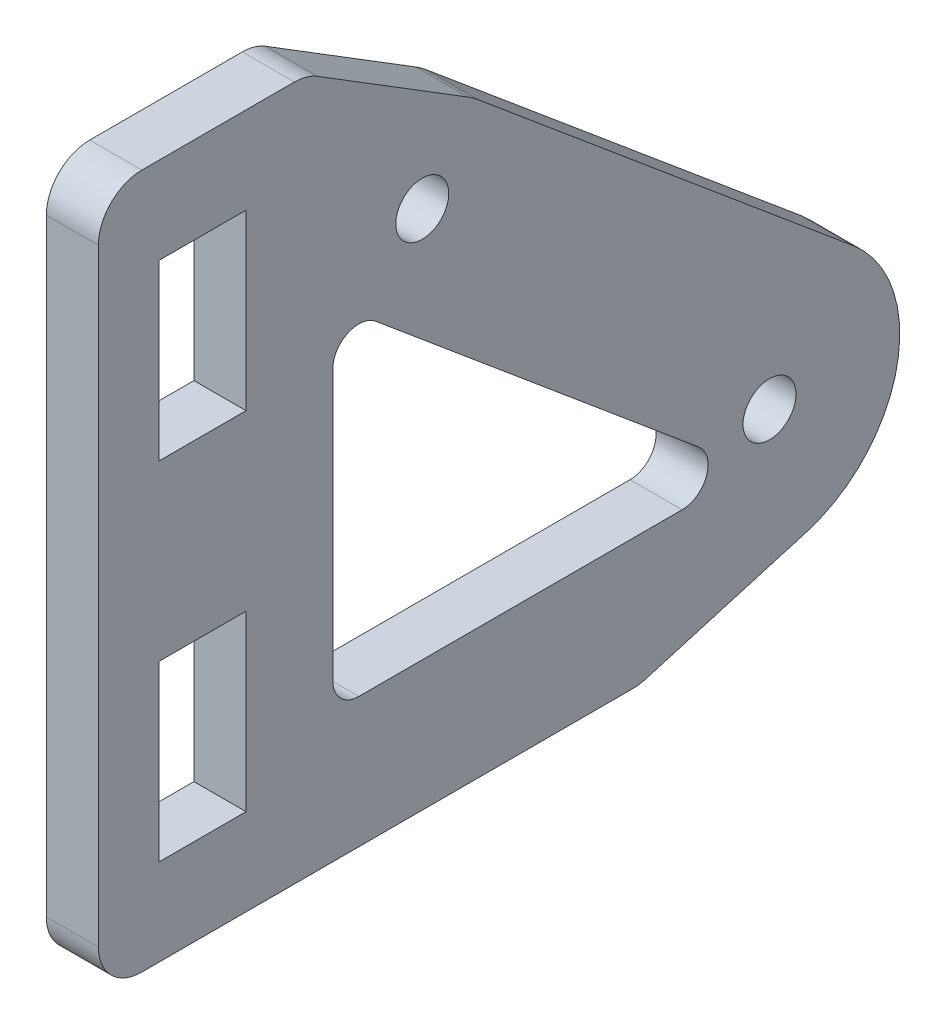
ISO-10303-21;
HEADER;
FILE_DESCRIPTION(('STEP AP214'),'2;1');
FILE_NAME('part.step','',(''),(''),'','','');
FILE_SCHEMA(('AUTOMOTIVE_DESIGN { 1 0 10303 214 1 1 1 1 }'));
ENDSEC;
DATA;
#1=APPLICATION_CONTEXT('core data for automotive mechanical design processes');
#2=APPLICATION_PROTOCOL_DEFINITION('international standard','automotive_design',2000,#1);
#3=PRODUCT_CONTEXT('',#1,'mechanical');
#4=PRODUCT('Part','Part','',(#3));
#5=PRODUCT_RELATED_PRODUCT_CATEGORY('part','',(#4));
#6=PRODUCT_DEFINITION_FORMATION('','',#4);
#7=PRODUCT_DEFINITION_CONTEXT('part definition',#1,'design');
#8=PRODUCT_DEFINITION('design','',#6,#7);
#9=PRODUCT_DEFINITION_SHAPE('','',#8);
#10=(LENGTH_UNIT() NAMED_UNIT(*) SI_UNIT(.MILLI.,.METRE.));
#11=(NAMED_UNIT(*) PLANE_ANGLE_UNIT() SI_UNIT($,.RADIAN.));
#12=(NAMED_UNIT(*) SI_UNIT($,.STERADIAN.) SOLID_ANGLE_UNIT());
#13=UNCERTAINTY_MEASURE_WITH_UNIT(LENGTH_MEASURE(1.E-05),#10,'distance_accuracy_value','');
#14=(GEOMETRIC_REPRESENTATION_CONTEXT(3) GLOBAL_UNCERTAINTY_ASSIGNED_CONTEXT((#13)) GLOBAL_UNIT_ASSIGNED_CONTEXT((#10,
#11,#12)) REPRESENTATION_CONTEXT('',''));
#15=CARTESIAN_POINT('',(0.,0.,0.));
#16=DIRECTION('',(0.,0.,1.));
#17=DIRECTION('',(1.,0.,0.));
#18=AXIS2_PLACEMENT_3D('',#15,#16,#17);
#19=CARTESIAN_POINT('',(1.5,-7.5,7.85714285714286));
#20=DIRECTION('',(1.,0.,0.));
#21=DIRECTION('',(0.,0.,-1.));
#22=AXIS2_PLACEMENT_3D('',#19,#20,#21);
#23=CYLINDRICAL_SURFACE('',#22,2.5);
#24=CARTESIAN_POINT('',(-1.5,-7.5,7.85714285714286));
#25=DIRECTION('',(1.,0.,0.));
#26=DIRECTION('',(0.,0.,-1.));
#27=AXIS2_PLACEMENT_3D('',#24,#25,#26);
#28=CIRCLE('',#27,2.5);
#29=CARTESIAN_POINT('',(-1.5,-10.,7.85714285714286));
#30=VERTEX_POINT('',#29);
#31=CARTESIAN_POINT('',(-1.5,-9.9,7.15714285714286));
#32=VERTEX_POINT('',#31);
#33=EDGE_CURVE('E309',#30,#32,#28,.T.);
#34=ORIENTED_EDGE('',*,*,#33,.T.);
#35=DIRECTION('',(1.,0.,0.));
#36=VECTOR('',#35,1.);
#37=CARTESIAN_POINT('',(1.5,-9.9,7.15714285714286));
#38=LINE('',#37,#36);
#39=CARTESIAN_POINT('',(1.5,-9.9,7.15714285714286));
#40=VERTEX_POINT('',#39);
#41=EDGE_CURVE('E152',#32,#40,#38,.T.);
#42=ORIENTED_EDGE('',*,*,#41,.T.);
#43=CARTESIAN_POINT('',(1.5,-7.5,7.85714285714286));
#44=DIRECTION('',(1.,0.,0.));
#45=DIRECTION('',(0.,0.,-1.));
#46=AXIS2_PLACEMENT_3D('',#43,#44,#45);
#47=CIRCLE('',#46,2.5);
#48=CARTESIAN_POINT('',(1.5,-10.,7.85714285714286));
#49=VERTEX_POINT('',#48);
#50=EDGE_CURVE('E19',#40,#49,#47,.F.);
#51=ORIENTED_EDGE('',*,*,#50,.T.);
#52=DIRECTION('',(1.,0.,0.));
#53=VECTOR('',#52,1.);
#54=CARTESIAN_POINT('',(1.5,-10.,7.85714285714286));
#55=LINE('',#54,#53);
#56=EDGE_CURVE('E149',#30,#49,#55,.T.);
#57=ORIENTED_EDGE('',*,*,#56,.F.);
#58=EDGE_LOOP('',(#34,#42,#51,#57));
#59=FACE_BOUND('',#58,.T.);
#60=ADVANCED_FACE('F16',(#59),#23,.T.);
#61=CARTESIAN_POINT('',(1.5,20.0000000000006,19.9999999999996));
#62=DIRECTION('',(-1.,0.,0.));
#63=DIRECTION('',(0.,0.,1.));
#64=AXIS2_PLACEMENT_3D('',#61,#62,#63);
#65=CYLINDRICAL_SURFACE('',#64,4.99999999999932);
#66=CARTESIAN_POINT('',(1.5,20.0000000000006,19.9999999999996));
#67=DIRECTION('',(-1.,0.,0.));
#68=DIRECTION('',(0.,0.,1.));
#69=AXIS2_PLACEMENT_3D('',#66,#67,#68);
#70=CIRCLE('',#69,4.99999999999932);
#71=CARTESIAN_POINT('',(1.5,24.2507487525087,17.3672951090094));
#72=VERTEX_POINT('',#71);
#73=CARTESIAN_POINT('',(1.5,23.8341961467452,16.7908038532548));
#74=VERTEX_POINT('',#73);
#75=EDGE_CURVE('E154',#72,#74,#70,.T.);
#76=ORIENTED_EDGE('',*,*,#75,.T.);
#77=DIRECTION('',(1.,0.,0.));
#78=VECTOR('',#77,1.);
#79=CARTESIAN_POINT('',(1.5,23.8341961467452,16.7908038532548));
#80=LINE('',#79,#78);
#81=CARTESIAN_POINT('',(-1.5,23.8341961467452,16.7908038532548));
#82=VERTEX_POINT('',#81);
#83=EDGE_CURVE('E251',#82,#74,#80,.T.);
#84=ORIENTED_EDGE('',*,*,#83,.F.);
#85=CARTESIAN_POINT('',(-1.5,20.0000000000006,19.9999999999996));
#86=DIRECTION('',(-1.,0.,0.));
#87=DIRECTION('',(0.,0.,1.));
#88=AXIS2_PLACEMENT_3D('',#85,#86,#87);
#89=CIRCLE('',#88,4.99999999999932);
#90=CARTESIAN_POINT('',(-1.5,24.2507487525087,17.3672951090094));
#91=VERTEX_POINT('',#90);
#92=EDGE_CURVE('E361',#82,#91,#89,.F.);
#93=ORIENTED_EDGE('',*,*,#92,.T.);
#94=DIRECTION('',(1.,0.,0.));
#95=VECTOR('',#94,1.);
#96=CARTESIAN_POINT('',(1.5,24.2507487525087,17.3672951090094));
#97=LINE('',#96,#95);
#98=EDGE_CURVE('E241',#72,#91,#97,.F.);
#99=ORIENTED_EDGE('',*,*,#98,.F.);
#100=EDGE_LOOP('',(#76,#84,#93,#99));
#101=FACE_BOUND('',#100,.T.);
#102=ADVANCED_FACE('F367',(#101),#65,.T.);
#103=CARTESIAN_POINT('',(1.5,27.5,27.3614842704696));
#104=DIRECTION('',(-1.,0.,0.));
#105=DIRECTION('',(0.,0.,1.));
#106=AXIS2_PLACEMENT_3D('',#103,#104,#105);
#107=CYLINDRICAL_SURFACE('',#106,2.5);
#108=CARTESIAN_POINT('',(-1.5,27.5,27.3614842704696));
#109=DIRECTION('',(-1.,0.,0.));
#110=DIRECTION('',(0.,0.,1.));
#111=AXIS2_PLACEMENT_3D('',#108,#109,#110);
#112=CIRCLE('',#111,2.5);
#113=CARTESIAN_POINT('',(-1.5,29.6253743762544,26.0451318249743));
#114=VERTEX_POINT('',#113);
#115=CARTESIAN_POINT('',(-1.5,30.,27.3614842704696));
#116=VERTEX_POINT('',#115);
#117=EDGE_CURVE('E359',#114,#116,#112,.F.);
#118=ORIENTED_EDGE('',*,*,#117,.T.);
#119=DIRECTION('',(1.,0.,0.));
#120=VECTOR('',#119,1.);
#121=CARTESIAN_POINT('',(1.5,30.,27.3614842704696));
#122=LINE('',#121,#120);
#123=CARTESIAN_POINT('',(1.5,30.,27.3614842704696));
#124=VERTEX_POINT('',#123);
#125=EDGE_CURVE('E238',#124,#116,#122,.F.);
#126=ORIENTED_EDGE('',*,*,#125,.F.);
#127=CARTESIAN_POINT('',(1.5,27.5,27.3614842704696));
#128=DIRECTION('',(-1.,0.,0.));
#129=DIRECTION('',(0.,0.,1.));
#130=AXIS2_PLACEMENT_3D('',#127,#128,#129);
#131=CIRCLE('',#130,2.5);
#132=CARTESIAN_POINT('',(1.5,29.6253743762544,26.0451318249743));
#133=VERTEX_POINT('',#132);
#134=EDGE_CURVE('E363',#124,#133,#131,.T.);
#135=ORIENTED_EDGE('',*,*,#134,.T.);
#136=DIRECTION('',(1.,0.,0.));
#137=VECTOR('',#136,1.);
#138=CARTESIAN_POINT('',(1.5,29.6253743762544,26.0451318249743));
#139=LINE('',#138,#137);
#140=EDGE_CURVE('E244',#114,#133,#139,.T.);
#141=ORIENTED_EDGE('',*,*,#140,.F.);
#142=EDGE_LOOP('',(#118,#126,#135,#141));
#143=FACE_BOUND('',#142,.T.);
#144=ADVANCED_FACE('F645',(#143),#107,.T.);
#145=CARTESIAN_POINT('',(-1.5,0.,0.));
#146=DIRECTION('',(1.,0.,0.));
#147=DIRECTION('',(0.,0.,-1.));
#148=AXIS2_PLACEMENT_3D('',#145,#146,#147);
#149=PLANE('',#148);
#150=CARTESIAN_POINT('',(-1.5,-1.,23.65));
#151=DIRECTION('',(-1.,0.,0.));
#152=DIRECTION('',(0.,0.,1.));
#153=AXIS2_PLACEMENT_3D('',#150,#151,#152);
#154=CIRCLE('',#153,1.5);
#155=CARTESIAN_POINT('',(-1.5,-1.,25.15));
#156=VERTEX_POINT('',#155);
#157=CARTESIAN_POINT('',(-1.5,-2.5,23.65));
#158=VERTEX_POINT('',#157);
#159=EDGE_CURVE('E203',#156,#158,#154,.F.);
#160=ORIENTED_EDGE('',*,*,#159,.T.);
#161=DIRECTION('',(0.,0.,1.));
#162=VECTOR('',#161,1.);
#163=CARTESIAN_POINT('',(-1.5,-2.5,0.));
#164=LINE('',#163,#162);
#165=CARTESIAN_POINT('',(-1.5,-2.5,5.03733742471625));
#166=VERTEX_POINT('',#165);
#167=EDGE_CURVE('E211',#166,#158,#164,.T.);
#168=ORIENTED_EDGE('',*,*,#167,.F.);
#169=CARTESIAN_POINT('',(-1.5,-1.,5.03733742471625));
#170=DIRECTION('',(-1.,0.,0.));
#171=DIRECTION('',(0.,0.,1.));
#172=AXIS2_PLACEMENT_3D('',#169,#170,#171);
#173=CIRCLE('',#172,1.5);
#174=CARTESIAN_POINT('',(-1.5,0.150258844023558,4.07457858069269));
#175=VERTEX_POINT('',#174);
#176=EDGE_CURVE('E214',#166,#175,#173,.F.);
#177=ORIENTED_EDGE('',*,*,#176,.T.);
#178=DIRECTION('',(0.,-0.64183922934904,-0.76683922934904));
#179=VECTOR('',#178,1.);
#180=CARTESIAN_POINT('',(-1.5,-1.9170980733726,1.6045980733726));
#181=LINE('',#180,#179);
#182=CARTESIAN_POINT('',(-1.5,15.7289310692238,22.6872411559764));
#183=VERTEX_POINT('',#182);
#184=EDGE_CURVE('E218',#183,#175,#181,.T.);
#185=ORIENTED_EDGE('',*,*,#184,.F.);
#186=CARTESIAN_POINT('',(-1.5,14.5786722252002,23.65));
#187=DIRECTION('',(-1.,0.,0.));
#188=DIRECTION('',(0.,0.,1.));
#189=AXIS2_PLACEMENT_3D('',#186,#187,#188);
#190=CIRCLE('',#189,1.5);
#191=CARTESIAN_POINT('',(-1.5,14.5786722252002,25.15));
#192=VERTEX_POINT('',#191);
#193=EDGE_CURVE('E221',#183,#192,#190,.F.);
#194=ORIENTED_EDGE('',*,*,#193,.T.);
#195=DIRECTION('',(0.,1.,0.));
#196=VECTOR('',#195,1.);
#197=CARTESIAN_POINT('',(-1.5,0.,25.15));
#198=LINE('',#197,#196);
#199=EDGE_CURVE('E222',#156,#192,#198,.T.);
#200=ORIENTED_EDGE('',*,*,#199,.F.);
#201=EDGE_LOOP('',(#160,#168,#177,#185,#194,#200));
#202=FACE_BOUND('',#201,.T.);
#203=ORIENTED_EDGE('',*,*,#33,.F.);
#204=DIRECTION('',(0.,0.,-1.));
#205=VECTOR('',#204,1.);
#206=CARTESIAN_POINT('',(-1.5,-10.,0.));
#207=LINE('',#206,#205);
#208=CARTESIAN_POINT('',(-1.5,-10.,36.15));
#209=VERTEX_POINT('',#208);
#210=EDGE_CURVE('E160',#209,#30,#207,.T.);
#211=ORIENTED_EDGE('',*,*,#210,.F.);
#212=CARTESIAN_POINT('',(-1.5,-7.50000000000001,36.15));
#213=DIRECTION('',(-1.,0.,0.));
#214=DIRECTION('',(0.,0.,1.));
#215=AXIS2_PLACEMENT_3D('',#212,#213,#214);
#216=CIRCLE('',#215,2.5);
#217=CARTESIAN_POINT('',(-1.5,-7.50000000000001,38.65));
#218=VERTEX_POINT('',#217);
#219=EDGE_CURVE('E225',#218,#209,#216,.F.);
#220=ORIENTED_EDGE('',*,*,#219,.F.);
#221=DIRECTION('',(0.,1.,0.));
#222=VECTOR('',#221,1.);
#223=CARTESIAN_POINT('',(-1.5,0.,38.65));
#224=LINE('',#223,#222);
#225=CARTESIAN_POINT('',(-1.5,27.5,38.65));
#226=VERTEX_POINT('',#225);
#227=EDGE_CURVE('E232',#226,#218,#224,.F.);
#228=ORIENTED_EDGE('',*,*,#227,.F.);
#229=CARTESIAN_POINT('',(-1.5,27.5,36.15));
#230=DIRECTION('',(-1.,0.,0.));
#231=DIRECTION('',(0.,0.,1.));
#232=AXIS2_PLACEMENT_3D('',#229,#230,#231);
#233=CIRCLE('',#232,2.5);
#234=CARTESIAN_POINT('',(-1.5,30.,36.15));
#235=VERTEX_POINT('',#234);
#236=EDGE_CURVE('E236',#235,#226,#233,.F.);
#237=ORIENTED_EDGE('',*,*,#236,.F.);
#238=DIRECTION('',(0.,0.,1.));
#239=VECTOR('',#238,1.);
#240=CARTESIAN_POINT('',(-1.5,30.,0.));
#241=LINE('',#240,#239);
#242=EDGE_CURVE('E237',#116,#235,#241,.T.);
#243=ORIENTED_EDGE('',*,*,#242,.F.);
#244=ORIENTED_EDGE('',*,*,#117,.F.);
#245=DIRECTION('',(0.,0.526540978198111,0.850149750501743));
#246=VECTOR('',#245,1.);
#247=CARTESIAN_POINT('',(-1.5,9.75306709319089,-6.04057048143544));
#248=LINE('',#247,#246);
#249=EDGE_CURVE('E247',#91,#114,#248,.T.);
#250=ORIENTED_EDGE('',*,*,#249,.F.);
#251=ORIENTED_EDGE('',*,*,#92,.F.);
#252=DIRECTION('',(0.,0.64183922934904,0.76683922934904));
#253=VECTOR('',#252,1.);
#254=CARTESIAN_POINT('',(-1.5,5.7512942201178,-4.8137942201178));
#255=LINE('',#254,#253);
#256=CARTESIAN_POINT('',(-1.5,5.75129422011782,-4.81379422011779));
#257=VERTEX_POINT('',#256);
#258=EDGE_CURVE('E254',#257,#82,#255,.T.);
#259=ORIENTED_EDGE('',*,*,#258,.F.);
#260=CARTESIAN_POINT('',(-1.5,0.,0.));
#261=DIRECTION('',(-1.,0.,0.));
#262=DIRECTION('',(0.,0.,1.));
#263=AXIS2_PLACEMENT_3D('',#260,#261,#262);
#264=CIRCLE('',#263,7.50000000000002);
#265=CARTESIAN_POINT('',(-1.5,-7.2,-2.09999999999999));
#266=VERTEX_POINT('',#265);
#267=EDGE_CURVE('E258',#266,#257,#264,.F.);
#268=ORIENTED_EDGE('',*,*,#267,.F.);
#269=DIRECTION('',(0.,-0.28,0.96));
#270=VECTOR('',#269,1.);
#271=CARTESIAN_POINT('',(-1.5,-7.2,-2.1));
#272=LINE('',#271,#270);
#273=EDGE_CURVE('E161',#266,#32,#272,.T.);
#274=ORIENTED_EDGE('',*,*,#273,.T.);
#275=EDGE_LOOP('',(#203,#211,#220,#228,#237,#243,#244,#250,#251,#259,#268,#274));
#276=FACE_BOUND('',#275,.T.);
#277=CARTESIAN_POINT('',(-1.5,20.,20.));
#278=DIRECTION('',(-1.,0.,0.));
#279=DIRECTION('',(0.,0.,1.));
#280=AXIS2_PLACEMENT_3D('',#277,#278,#279);
#281=CIRCLE('',#280,1.525);
#282=CARTESIAN_POINT('',(-1.5,20.,21.525));
#283=VERTEX_POINT('',#282);
#284=EDGE_CURVE('E314',#283,#283,#281,.F.);
#285=ORIENTED_EDGE('',*,*,#284,.T.);
#286=EDGE_LOOP('',(#285));
#287=FACE_BOUND('',#286,.T.);
#288=CARTESIAN_POINT('',(-1.5,0.,0.));
#289=DIRECTION('',(-1.,0.,0.));
#290=DIRECTION('',(0.,0.,1.));
#291=AXIS2_PLACEMENT_3D('',#288,#289,#290);
#292=CIRCLE('',#291,1.525);
#293=CARTESIAN_POINT('',(-1.5,0.,1.525));
#294=VERTEX_POINT('',#293);
#295=EDGE_CURVE('E263',#294,#294,#292,.F.);
#296=ORIENTED_EDGE('',*,*,#295,.T.);
#297=EDGE_LOOP('',(#296));
#298=FACE_BOUND('',#297,.T.);
#299=DIRECTION('',(0.,1.,0.));
#300=VECTOR('',#299,1.);
#301=CARTESIAN_POINT('',(-1.5,0.,35.15));
#302=LINE('',#301,#300);
#303=CARTESIAN_POINT('',(-1.5,-5.,35.15));
#304=VERTEX_POINT('',#303);
#305=CARTESIAN_POINT('',(-1.5,5.,35.15));
#306=VERTEX_POINT('',#305);
#307=EDGE_CURVE('E267',#304,#306,#302,.T.);
#308=ORIENTED_EDGE('',*,*,#307,.F.);
#309=DIRECTION('',(0.,0.,1.));
#310=VECTOR('',#309,1.);
#311=CARTESIAN_POINT('',(-1.5,-5.,0.));
#312=LINE('',#311,#310);
#313=CARTESIAN_POINT('',(-1.5,-5.,30.15));
#314=VERTEX_POINT('',#313);
#315=EDGE_CURVE('E273',#314,#304,#312,.T.);
#316=ORIENTED_EDGE('',*,*,#315,.F.);
#317=DIRECTION('',(0.,1.,0.));
#318=VECTOR('',#317,1.);
#319=CARTESIAN_POINT('',(-1.5,0.,30.15));
#320=LINE('',#319,#318);
#321=CARTESIAN_POINT('',(-1.5,5.,30.15));
#322=VERTEX_POINT('',#321);
#323=EDGE_CURVE('E276',#314,#322,#320,.T.);
#324=ORIENTED_EDGE('',*,*,#323,.T.);
#325=DIRECTION('',(0.,0.,1.));
#326=VECTOR('',#325,1.);
#327=CARTESIAN_POINT('',(-1.5,5.,0.));
#328=LINE('',#327,#326);
#329=EDGE_CURVE('E282',#322,#306,#328,.T.);
#330=ORIENTED_EDGE('',*,*,#329,.T.);
#331=EDGE_LOOP('',(#308,#316,#324,#330));
#332=FACE_BOUND('',#331,.T.);
#333=DIRECTION('',(0.,1.,0.));
#334=VECTOR('',#333,1.);
#335=CARTESIAN_POINT('',(-1.5,0.,35.15));
#336=LINE('',#335,#334);
#337=CARTESIAN_POINT('',(-1.5,15.,35.15));
#338=VERTEX_POINT('',#337);
#339=CARTESIAN_POINT('',(-1.5,25.,35.15));
#340=VERTEX_POINT('',#339);
#341=EDGE_CURVE('E291',#338,#340,#336,.T.);
#342=ORIENTED_EDGE('',*,*,#341,.F.);
#343=DIRECTION('',(0.,0.,1.));
#344=VECTOR('',#343,1.);
#345=CARTESIAN_POINT('',(-1.5,15.,0.));
#346=LINE('',#345,#344);
#347=CARTESIAN_POINT('',(-1.5,15.,30.15));
#348=VERTEX_POINT('',#347);
#349=EDGE_CURVE('E297',#348,#338,#346,.T.);
#350=ORIENTED_EDGE('',*,*,#349,.F.);
#351=DIRECTION('',(0.,1.,0.));
#352=VECTOR('',#351,1.);
#353=CARTESIAN_POINT('',(-1.5,0.,30.15));
#354=LINE('',#353,#352);
#355=CARTESIAN_POINT('',(-1.5,25.,30.15));
#356=VERTEX_POINT('',#355);
#357=EDGE_CURVE('E300',#348,#356,#354,.T.);
#358=ORIENTED_EDGE('',*,*,#357,.T.);
#359=DIRECTION('',(0.,0.,1.));
#360=VECTOR('',#359,1.);
#361=CARTESIAN_POINT('',(-1.5,25.,0.));
#362=LINE('',#361,#360);
#363=EDGE_CURVE('E306',#356,#340,#362,.T.);
#364=ORIENTED_EDGE('',*,*,#363,.T.);
#365=EDGE_LOOP('',(#342,#350,#358,#364));
#366=FACE_BOUND('',#365,.T.);
#367=ADVANCED_FACE('F394',(#202,#276,#287,#298,#332,#366),#149,.F.);
#368=CARTESIAN_POINT('',(1.5,25.,0.));
#369=DIRECTION('',(0.,1.,0.));
#370=DIRECTION('',(0.,0.,1.));
#371=AXIS2_PLACEMENT_3D('',#368,#369,#370);
#372=PLANE('',#371);
#373=DIRECTION('',(-1.,0.,0.));
#374=VECTOR('',#373,1.);
#375=CARTESIAN_POINT('',(1.5,25.,30.15));
#376=LINE('',#375,#374);
#377=CARTESIAN_POINT('',(1.5,25.,30.15));
#378=VERTEX_POINT('',#377);
#379=EDGE_CURVE('E303',#356,#378,#376,.F.);
#380=ORIENTED_EDGE('',*,*,#379,.T.);
#381=DIRECTION('',(0.,0.,-1.));
#382=VECTOR('',#381,1.);
#383=CARTESIAN_POINT('',(1.5,25.,0.));
#384=LINE('',#383,#382);
#385=CARTESIAN_POINT('',(1.5,25.,35.15));
#386=VERTEX_POINT('',#385);
#387=EDGE_CURVE('E200',#386,#378,#384,.T.);
#388=ORIENTED_EDGE('',*,*,#387,.F.);
#389=DIRECTION('',(-1.,0.,0.));
#390=VECTOR('',#389,1.);
#391=CARTESIAN_POINT('',(1.5,25.,35.15));
#392=LINE('',#391,#390);
#393=EDGE_CURVE('E288',#340,#386,#392,.F.);
#394=ORIENTED_EDGE('',*,*,#393,.F.);
#395=ORIENTED_EDGE('',*,*,#363,.F.);
#396=EDGE_LOOP('',(#380,#388,#394,#395));
#397=FACE_BOUND('',#396,.T.);
#398=ADVANCED_FACE('F628',(#397),#372,.F.);
#399=CARTESIAN_POINT('',(1.5,0.,30.15));
#400=DIRECTION('',(0.,0.,-1.));
#401=DIRECTION('',(-1.,0.,0.));
#402=AXIS2_PLACEMENT_3D('',#399,#400,#401);
#403=PLANE('',#402);
#404=DIRECTION('',(1.,0.,0.));
#405=VECTOR('',#404,1.);
#406=CARTESIAN_POINT('',(1.5,15.,30.15));
#407=LINE('',#406,#405);
#408=CARTESIAN_POINT('',(1.5,15.,30.15));
#409=VERTEX_POINT('',#408);
#410=EDGE_CURVE('E294',#409,#348,#407,.F.);
#411=ORIENTED_EDGE('',*,*,#410,.F.);
#412=DIRECTION('',(0.,1.,0.));
#413=VECTOR('',#412,1.);
#414=CARTESIAN_POINT('',(1.5,0.,30.15));
#415=LINE('',#414,#413);
#416=EDGE_CURVE('E197',#378,#409,#415,.F.);
#417=ORIENTED_EDGE('',*,*,#416,.F.);
#418=ORIENTED_EDGE('',*,*,#379,.F.);
#419=ORIENTED_EDGE('',*,*,#357,.F.);
#420=EDGE_LOOP('',(#411,#417,#418,#419));
#421=FACE_BOUND('',#420,.T.);
#422=ADVANCED_FACE('F619',(#421),#403,.F.);
#423=CARTESIAN_POINT('',(1.5,15.,0.));
#424=DIRECTION('',(0.,1.,0.));
#425=DIRECTION('',(0.,0.,1.));
#426=AXIS2_PLACEMENT_3D('',#423,#424,#425);
#427=PLANE('',#426);
#428=DIRECTION('',(0.,0.,-1.));
#429=VECTOR('',#428,1.);
#430=CARTESIAN_POINT('',(1.5,15.,0.));
#431=LINE('',#430,#429);
#432=CARTESIAN_POINT('',(1.5,15.,35.15));
#433=VERTEX_POINT('',#432);
#434=EDGE_CURVE('E194',#409,#433,#431,.F.);
#435=ORIENTED_EDGE('',*,*,#434,.F.);
#436=ORIENTED_EDGE('',*,*,#410,.T.);
#437=ORIENTED_EDGE('',*,*,#349,.T.);
#438=DIRECTION('',(-1.,0.,0.));
#439=VECTOR('',#438,1.);
#440=CARTESIAN_POINT('',(1.5,15.,35.15));
#441=LINE('',#440,#439);
#442=EDGE_CURVE('E285',#433,#338,#441,.T.);
#443=ORIENTED_EDGE('',*,*,#442,.F.);
#444=EDGE_LOOP('',(#435,#436,#437,#443));
#445=FACE_BOUND('',#444,.T.);
#446=ADVANCED_FACE('F610',(#445),#427,.T.);
#447=CARTESIAN_POINT('',(1.5,0.,35.15));
#448=DIRECTION('',(0.,0.,-1.));
#449=DIRECTION('',(-1.,0.,0.));
#450=AXIS2_PLACEMENT_3D('',#447,#448,#449);
#451=PLANE('',#450);
#452=DIRECTION('',(0.,1.,0.));
#453=VECTOR('',#452,1.);
#454=CARTESIAN_POINT('',(1.5,0.,35.15));
#455=LINE('',#454,#453);
#456=EDGE_CURVE('E191',#433,#386,#455,.T.);
#457=ORIENTED_EDGE('',*,*,#456,.F.);
#458=ORIENTED_EDGE('',*,*,#442,.T.);
#459=ORIENTED_EDGE('',*,*,#341,.T.);
#460=ORIENTED_EDGE('',*,*,#393,.T.);
#461=EDGE_LOOP('',(#457,#458,#459,#460));
#462=FACE_BOUND('',#461,.T.);
#463=ADVANCED_FACE('F601',(#462),#451,.T.);
#464=CARTESIAN_POINT('',(1.5,5.,0.));
#465=DIRECTION('',(0.,1.,0.));
#466=DIRECTION('',(0.,0.,1.));
#467=AXIS2_PLACEMENT_3D('',#464,#465,#466);
#468=PLANE('',#467);
#469=DIRECTION('',(-1.,0.,0.));
#470=VECTOR('',#469,1.);
#471=CARTESIAN_POINT('',(1.5,5.,30.15));
#472=LINE('',#471,#470);
#473=CARTESIAN_POINT('',(1.5,5.,30.15));
#474=VERTEX_POINT('',#473);
#475=EDGE_CURVE('E279',#322,#474,#472,.F.);
#476=ORIENTED_EDGE('',*,*,#475,.T.);
#477=DIRECTION('',(0.,0.,-1.));
#478=VECTOR('',#477,1.);
#479=CARTESIAN_POINT('',(1.5,5.,0.));
#480=LINE('',#479,#478);
#481=CARTESIAN_POINT('',(1.5,5.,35.15));
#482=VERTEX_POINT('',#481);
#483=EDGE_CURVE('E188',#482,#474,#480,.T.);
#484=ORIENTED_EDGE('',*,*,#483,.F.);
#485=DIRECTION('',(-1.,0.,0.));
#486=VECTOR('',#485,1.);
#487=CARTESIAN_POINT('',(1.5,5.,35.15));
#488=LINE('',#487,#486);
#489=EDGE_CURVE('E264',#306,#482,#488,.F.);
#490=ORIENTED_EDGE('',*,*,#489,.F.);
#491=ORIENTED_EDGE('',*,*,#329,.F.);
#492=EDGE_LOOP('',(#476,#484,#490,#491));
#493=FACE_BOUND('',#492,.T.);
#494=ADVANCED_FACE('F592',(#493),#468,.F.);
#495=CARTESIAN_POINT('',(1.5,0.,30.15));
#496=DIRECTION('',(0.,0.,-1.));
#497=DIRECTION('',(-1.,0.,0.));
#498=AXIS2_PLACEMENT_3D('',#495,#496,#497);
#499=PLANE('',#498);
#500=DIRECTION('',(1.,0.,0.));
#501=VECTOR('',#500,1.);
#502=CARTESIAN_POINT('',(1.5,-5.,30.15));
#503=LINE('',#502,#501);
#504=CARTESIAN_POINT('',(1.5,-5.,30.15));
#505=VERTEX_POINT('',#504);
#506=EDGE_CURVE('E270',#505,#314,#503,.F.);
#507=ORIENTED_EDGE('',*,*,#506,.F.);
#508=DIRECTION('',(0.,1.,0.));
#509=VECTOR('',#508,1.);
#510=CARTESIAN_POINT('',(1.5,0.,30.15));
#511=LINE('',#510,#509);
#512=EDGE_CURVE('E185',#474,#505,#511,.F.);
#513=ORIENTED_EDGE('',*,*,#512,.F.);
#514=ORIENTED_EDGE('',*,*,#475,.F.);
#515=ORIENTED_EDGE('',*,*,#323,.F.);
#516=EDGE_LOOP('',(#507,#513,#514,#515));
#517=FACE_BOUND('',#516,.T.);
#518=ADVANCED_FACE('F583',(#517),#499,.F.);
#519=CARTESIAN_POINT('',(1.5,-5.,0.));
#520=DIRECTION('',(0.,1.,0.));
#521=DIRECTION('',(0.,0.,1.));
#522=AXIS2_PLACEMENT_3D('',#519,#520,#521);
#523=PLANE('',#522);
#524=DIRECTION('',(0.,0.,-1.));
#525=VECTOR('',#524,1.);
#526=CARTESIAN_POINT('',(1.5,-5.,0.));
#527=LINE('',#526,#525);
#528=CARTESIAN_POINT('',(1.5,-5.,35.15));
#529=VERTEX_POINT('',#528);
#530=EDGE_CURVE('E182',#505,#529,#527,.F.);
#531=ORIENTED_EDGE('',*,*,#530,.F.);
#532=ORIENTED_EDGE('',*,*,#506,.T.);
#533=ORIENTED_EDGE('',*,*,#315,.T.);
#534=DIRECTION('',(-1.,0.,0.));
#535=VECTOR('',#534,1.);
#536=CARTESIAN_POINT('',(1.5,-5.,35.15));
#537=LINE('',#536,#535);
#538=EDGE_CURVE('E260',#529,#304,#537,.T.);
#539=ORIENTED_EDGE('',*,*,#538,.F.);
#540=EDGE_LOOP('',(#531,#532,#533,#539));
#541=FACE_BOUND('',#540,.T.);
#542=ADVANCED_FACE('F574',(#541),#523,.T.);
#543=CARTESIAN_POINT('',(1.5,0.,35.15));
#544=DIRECTION('',(0.,0.,-1.));
#545=DIRECTION('',(-1.,0.,0.));
#546=AXIS2_PLACEMENT_3D('',#543,#544,#545);
#547=PLANE('',#546);
#548=DIRECTION('',(0.,1.,0.));
#549=VECTOR('',#548,1.);
#550=CARTESIAN_POINT('',(1.5,0.,35.15));
#551=LINE('',#550,#549);
#552=EDGE_CURVE('E179',#529,#482,#551,.T.);
#553=ORIENTED_EDGE('',*,*,#552,.F.);
#554=ORIENTED_EDGE('',*,*,#538,.T.);
#555=ORIENTED_EDGE('',*,*,#307,.T.);
#556=ORIENTED_EDGE('',*,*,#489,.T.);
#557=EDGE_LOOP('',(#553,#554,#555,#556));
#558=FACE_BOUND('',#557,.T.);
#559=ADVANCED_FACE('F565',(#558),#547,.T.);
#560=CARTESIAN_POINT('',(1.5,0.,0.));
#561=DIRECTION('',(-1.,0.,0.));
#562=DIRECTION('',(0.,0.,1.));
#563=AXIS2_PLACEMENT_3D('',#560,#561,#562);
#564=CYLINDRICAL_SURFACE('',#563,1.525);
#565=CARTESIAN_POINT('',(1.5,0.,0.));
#566=DIRECTION('',(-1.,0.,0.));
#567=DIRECTION('',(0.,0.,1.));
#568=AXIS2_PLACEMENT_3D('',#565,#566,#567);
#569=CIRCLE('',#568,1.525);
#570=CARTESIAN_POINT('',(1.5,0.,1.525));
#571=VERTEX_POINT('',#570);
#572=EDGE_CURVE('E175',#571,#571,#569,.T.);
#573=ORIENTED_EDGE('',*,*,#572,.F.);
#574=EDGE_LOOP('',(#573));
#575=FACE_BOUND('',#574,.T.);
#576=ORIENTED_EDGE('',*,*,#295,.F.);
#577=EDGE_LOOP('',(#576));
#578=FACE_BOUND('',#577,.T.);
#579=ADVANCED_FACE('F556',(#575,#578),#564,.F.);
#580=CARTESIAN_POINT('',(1.5,20.,20.));
#581=DIRECTION('',(-1.,0.,0.));
#582=DIRECTION('',(0.,0.,1.));
#583=AXIS2_PLACEMENT_3D('',#580,#581,#582);
#584=CYLINDRICAL_SURFACE('',#583,1.525);
#585=CARTESIAN_POINT('',(1.5,20.,20.));
#586=DIRECTION('',(-1.,0.,0.));
#587=DIRECTION('',(0.,0.,1.));
#588=AXIS2_PLACEMENT_3D('',#585,#586,#587);
#589=CIRCLE('',#588,1.525);
#590=CARTESIAN_POINT('',(1.5,20.,21.525));
#591=VERTEX_POINT('',#590);
#592=EDGE_CURVE('E170',#591,#591,#589,.T.);
#593=ORIENTED_EDGE('',*,*,#592,.F.);
#594=EDGE_LOOP('',(#593));
#595=FACE_BOUND('',#594,.T.);
#596=ORIENTED_EDGE('',*,*,#284,.F.);
#597=EDGE_LOOP('',(#596));
#598=FACE_BOUND('',#597,.T.);
#599=ADVANCED_FACE('F548',(#595,#598),#584,.F.);
#600=CARTESIAN_POINT('',(1.5,-10.,0.));
#601=DIRECTION('',(0.,-1.,0.));
#602=DIRECTION('',(0.,0.,-1.));
#603=AXIS2_PLACEMENT_3D('',#600,#601,#602);
#604=PLANE('',#603);
#605=DIRECTION('',(0.,0.,-1.));
#606=VECTOR('',#605,1.);
#607=CARTESIAN_POINT('',(1.5,-10.,0.));
#608=LINE('',#607,#606);
#609=CARTESIAN_POINT('',(1.5,-10.,36.15));
#610=VERTEX_POINT('',#609);
#611=EDGE_CURVE('E158',#610,#49,#608,.T.);
#612=ORIENTED_EDGE('',*,*,#611,.F.);
#613=DIRECTION('',(-1.,0.,0.));
#614=VECTOR('',#613,1.);
#615=CARTESIAN_POINT('',(1.5,-10.,36.15));
#616=LINE('',#615,#614);
#617=EDGE_CURVE('E223',#209,#610,#616,.F.);
#618=ORIENTED_EDGE('',*,*,#617,.F.);
#619=ORIENTED_EDGE('',*,*,#210,.T.);
#620=ORIENTED_EDGE('',*,*,#56,.T.);
#621=EDGE_LOOP('',(#612,#618,#619,#620));
#622=FACE_BOUND('',#621,.T.);
#623=ADVANCED_FACE('F156',(#622),#604,.T.);
#624=CARTESIAN_POINT('',(1.5,-7.2,-2.1));
#625=DIRECTION('',(0.,0.96,0.28));
#626=DIRECTION('',(0.,-0.28,0.96));
#627=AXIS2_PLACEMENT_3D('',#624,#625,#626);
#628=PLANE('',#627);
#629=ORIENTED_EDGE('',*,*,#41,.F.);
#630=ORIENTED_EDGE('',*,*,#273,.F.);
#631=DIRECTION('',(-1.,0.,0.));
#632=VECTOR('',#631,1.);
#633=CARTESIAN_POINT('',(1.5,-7.2,-2.10000000000001));
#634=LINE('',#633,#632);
#635=CARTESIAN_POINT('',(1.5,-7.2,-2.09999999999999));
#636=VERTEX_POINT('',#635);
#637=EDGE_CURVE('E255',#636,#266,#634,.T.);
#638=ORIENTED_EDGE('',*,*,#637,.F.);
#639=DIRECTION('',(0.,0.28,-0.96));
#640=VECTOR('',#639,1.);
#641=CARTESIAN_POINT('',(1.5,-9.9,7.15714285714286));
#642=LINE('',#641,#640);
#643=EDGE_CURVE('E169',#40,#636,#642,.T.);
#644=ORIENTED_EDGE('',*,*,#643,.F.);
#645=EDGE_LOOP('',(#629,#630,#638,#644));
#646=FACE_BOUND('',#645,.T.);
#647=ADVANCED_FACE('F531',(#646),#628,.F.);
#648=CARTESIAN_POINT('',(1.5,0.,0.));
#649=DIRECTION('',(-1.,0.,0.));
#650=DIRECTION('',(0.,0.,1.));
#651=AXIS2_PLACEMENT_3D('',#648,#649,#650);
#652=CYLINDRICAL_SURFACE('',#651,7.50000000000002);
#653=CARTESIAN_POINT('',(1.5,0.,0.));
#654=DIRECTION('',(-1.,0.,0.));
#655=DIRECTION('',(0.,0.,1.));
#656=AXIS2_PLACEMENT_3D('',#653,#654,#655);
#657=CIRCLE('',#656,7.50000000000002);
#658=CARTESIAN_POINT('',(1.5,5.75129422011781,-4.81379422011779));
#659=VERTEX_POINT('',#658);
#660=EDGE_CURVE('E172',#636,#659,#657,.F.);
#661=ORIENTED_EDGE('',*,*,#660,.F.);
#662=ORIENTED_EDGE('',*,*,#637,.T.);
#663=ORIENTED_EDGE('',*,*,#267,.T.);
#664=DIRECTION('',(1.,0.,0.));
#665=VECTOR('',#664,1.);
#666=CARTESIAN_POINT('',(1.5,5.7512942201178,-4.8137942201178));
#667=LINE('',#666,#665);
#668=EDGE_CURVE('E248',#659,#257,#667,.F.);
#669=ORIENTED_EDGE('',*,*,#668,.F.);
#670=EDGE_LOOP('',(#661,#662,#663,#669));
#671=FACE_BOUND('',#670,.T.);
#672=ADVANCED_FACE('F523',(#671),#652,.T.);
#673=CARTESIAN_POINT('',(1.5,5.7512942201178,-4.8137942201178));
#674=DIRECTION('',(0.,0.76683922934904,-0.64183922934904));
#675=DIRECTION('',(0.,0.64183922934904,0.76683922934904));
#676=AXIS2_PLACEMENT_3D('',#673,#674,#675);
#677=PLANE('',#676);
#678=DIRECTION('',(0.,0.64183922934904,0.76683922934904));
#679=VECTOR('',#678,1.);
#680=CARTESIAN_POINT('',(1.5,5.7512942201178,-4.8137942201178));
#681=LINE('',#680,#679);
#682=EDGE_CURVE('E338',#659,#74,#681,.T.);
#683=ORIENTED_EDGE('',*,*,#682,.F.);
#684=ORIENTED_EDGE('',*,*,#668,.T.);
#685=ORIENTED_EDGE('',*,*,#258,.T.);
#686=ORIENTED_EDGE('',*,*,#83,.T.);
#687=EDGE_LOOP('',(#683,#684,#685,#686));
#688=FACE_BOUND('',#687,.T.);
#689=ADVANCED_FACE('F373',(#688),#677,.T.);
#690=CARTESIAN_POINT('',(1.5,9.75306709319089,-6.04057048143544));
#691=DIRECTION('',(0.,0.850149750501743,-0.526540978198111));
#692=DIRECTION('',(0.,0.526540978198111,0.850149750501743));
#693=AXIS2_PLACEMENT_3D('',#690,#691,#692);
#694=PLANE('',#693);
#695=DIRECTION('',(0.,0.526540978198111,0.850149750501743));
#696=VECTOR('',#695,1.);
#697=CARTESIAN_POINT('',(1.5,24.2507487525087,17.3672951090094));
#698=LINE('',#697,#696);
#699=EDGE_CURVE('E375',#72,#133,#698,.T.);
#700=ORIENTED_EDGE('',*,*,#699,.F.);
#701=ORIENTED_EDGE('',*,*,#98,.T.);
#702=ORIENTED_EDGE('',*,*,#249,.T.);
#703=ORIENTED_EDGE('',*,*,#140,.T.);
#704=EDGE_LOOP('',(#700,#701,#702,#703));
#705=FACE_BOUND('',#704,.T.);
#706=ADVANCED_FACE('F506',(#705),#694,.T.);
#707=CARTESIAN_POINT('',(1.5,30.,0.));
#708=DIRECTION('',(0.,1.,0.));
#709=DIRECTION('',(0.,0.,1.));
#710=AXIS2_PLACEMENT_3D('',#707,#708,#709);
#711=PLANE('',#710);
#712=ORIENTED_EDGE('',*,*,#242,.T.);
#713=DIRECTION('',(-1.,0.,0.));
#714=VECTOR('',#713,1.);
#715=CARTESIAN_POINT('',(1.5,30.,36.15));
#716=LINE('',#715,#714);
#717=CARTESIAN_POINT('',(1.5,30.,36.15));
#718=VERTEX_POINT('',#717);
#719=EDGE_CURVE('E233',#718,#235,#716,.T.);
#720=ORIENTED_EDGE('',*,*,#719,.F.);
#721=DIRECTION('',(0.,0.,-1.));
#722=VECTOR('',#721,1.);
#723=CARTESIAN_POINT('',(1.5,30.,0.));
#724=LINE('',#723,#722);
#725=EDGE_CURVE('E336',#124,#718,#724,.F.);
#726=ORIENTED_EDGE('',*,*,#725,.F.);
#727=ORIENTED_EDGE('',*,*,#125,.T.);
#728=EDGE_LOOP('',(#712,#720,#726,#727));
#729=FACE_BOUND('',#728,.T.);
#730=ADVANCED_FACE('F497',(#729),#711,.T.);
#731=CARTESIAN_POINT('',(1.5,27.5,36.15));
#732=DIRECTION('',(-1.,0.,0.));
#733=DIRECTION('',(0.,0.,1.));
#734=AXIS2_PLACEMENT_3D('',#731,#732,#733);
#735=CYLINDRICAL_SURFACE('',#734,2.5);
#736=ORIENTED_EDGE('',*,*,#236,.T.);
#737=DIRECTION('',(1.,0.,0.));
#738=VECTOR('',#737,1.);
#739=CARTESIAN_POINT('',(1.5,27.5,38.65));
#740=LINE('',#739,#738);
#741=CARTESIAN_POINT('',(1.5,27.5,38.65));
#742=VERTEX_POINT('',#741);
#743=EDGE_CURVE('E229',#742,#226,#740,.F.);
#744=ORIENTED_EDGE('',*,*,#743,.F.);
#745=CARTESIAN_POINT('',(1.5,27.5,36.15));
#746=DIRECTION('',(-1.,0.,0.));
#747=DIRECTION('',(0.,0.,1.));
#748=AXIS2_PLACEMENT_3D('',#745,#746,#747);
#749=CIRCLE('',#748,2.5);
#750=EDGE_CURVE('E333',#718,#742,#749,.F.);
#751=ORIENTED_EDGE('',*,*,#750,.F.);
#752=ORIENTED_EDGE('',*,*,#719,.T.);
#753=EDGE_LOOP('',(#736,#744,#751,#752));
#754=FACE_BOUND('',#753,.T.);
#755=ADVANCED_FACE('F488',(#754),#735,.T.);
#756=CARTESIAN_POINT('',(1.5,0.,38.65));
#757=DIRECTION('',(0.,0.,1.));
#758=DIRECTION('',(1.,0.,0.));
#759=AXIS2_PLACEMENT_3D('',#756,#757,#758);
#760=PLANE('',#759);
#761=DIRECTION('',(0.,1.,0.));
#762=VECTOR('',#761,1.);
#763=CARTESIAN_POINT('',(1.5,0.,38.65));
#764=LINE('',#763,#762);
#765=CARTESIAN_POINT('',(1.5,-7.50000000000001,38.65));
#766=VERTEX_POINT('',#765);
#767=EDGE_CURVE('E332',#742,#766,#764,.F.);
#768=ORIENTED_EDGE('',*,*,#767,.F.);
#769=ORIENTED_EDGE('',*,*,#743,.T.);
#770=ORIENTED_EDGE('',*,*,#227,.T.);
#771=DIRECTION('',(-1.,0.,0.));
#772=VECTOR('',#771,1.);
#773=CARTESIAN_POINT('',(1.5,-7.50000000000001,38.65));
#774=LINE('',#773,#772);
#775=EDGE_CURVE('E226',#766,#218,#774,.T.);
#776=ORIENTED_EDGE('',*,*,#775,.F.);
#777=EDGE_LOOP('',(#768,#769,#770,#776));
#778=FACE_BOUND('',#777,.T.);
#779=ADVANCED_FACE('F479',(#778),#760,.T.);
#780=CARTESIAN_POINT('',(1.5,-7.50000000000001,36.15));
#781=DIRECTION('',(-1.,0.,0.));
#782=DIRECTION('',(0.,0.,1.));
#783=AXIS2_PLACEMENT_3D('',#780,#781,#782);
#784=CYLINDRICAL_SURFACE('',#783,2.5);
#785=ORIENTED_EDGE('',*,*,#219,.T.);
#786=ORIENTED_EDGE('',*,*,#617,.T.);
#787=CARTESIAN_POINT('',(1.5,-7.50000000000001,36.15));
#788=DIRECTION('',(-1.,0.,0.));
#789=DIRECTION('',(0.,0.,1.));
#790=AXIS2_PLACEMENT_3D('',#787,#788,#789);
#791=CIRCLE('',#790,2.5);
#792=EDGE_CURVE('E168',#766,#610,#791,.F.);
#793=ORIENTED_EDGE('',*,*,#792,.F.);
#794=ORIENTED_EDGE('',*,*,#775,.T.);
#795=EDGE_LOOP('',(#785,#786,#793,#794));
#796=FACE_BOUND('',#795,.T.);
#797=ADVANCED_FACE('F471',(#796),#784,.T.);
#798=CARTESIAN_POINT('',(1.5,0.,25.15));
#799=DIRECTION('',(0.,0.,-1.));
#800=DIRECTION('',(-1.,0.,0.));
#801=AXIS2_PLACEMENT_3D('',#798,#799,#800);
#802=PLANE('',#801);
#803=DIRECTION('',(0.,1.,0.));
#804=VECTOR('',#803,1.);
#805=CARTESIAN_POINT('',(1.5,0.,25.15));
#806=LINE('',#805,#804);
#807=CARTESIAN_POINT('',(1.5,-1.,25.15));
#808=VERTEX_POINT('',#807);
#809=CARTESIAN_POINT('',(1.5,14.5786722252002,25.15));
#810=VERTEX_POINT('',#809);
#811=EDGE_CURVE('E330',#808,#810,#806,.T.);
#812=ORIENTED_EDGE('',*,*,#811,.F.);
#813=DIRECTION('',(-1.,0.,0.));
#814=VECTOR('',#813,1.);
#815=CARTESIAN_POINT('',(1.5,-1.,25.15));
#816=LINE('',#815,#814);
#817=EDGE_CURVE('E205',#808,#156,#816,.T.);
#818=ORIENTED_EDGE('',*,*,#817,.T.);
#819=ORIENTED_EDGE('',*,*,#199,.T.);
#820=DIRECTION('',(-1.,0.,0.));
#821=VECTOR('',#820,1.);
#822=CARTESIAN_POINT('',(1.5,14.5786722252002,25.15));
#823=LINE('',#822,#821);
#824=EDGE_CURVE('E219',#192,#810,#823,.F.);
#825=ORIENTED_EDGE('',*,*,#824,.T.);
#826=EDGE_LOOP('',(#812,#818,#819,#825));
#827=FACE_BOUND('',#826,.T.);
#828=ADVANCED_FACE('F402',(#827),#802,.T.);
#829=CARTESIAN_POINT('',(1.5,14.5786722252002,23.65));
#830=DIRECTION('',(-1.,0.,0.));
#831=DIRECTION('',(0.,0.,1.));
#832=AXIS2_PLACEMENT_3D('',#829,#830,#831);
#833=CYLINDRICAL_SURFACE('',#832,1.5);
#834=DIRECTION('',(1.,0.,0.));
#835=VECTOR('',#834,1.);
#836=CARTESIAN_POINT('',(1.5,15.7289310692238,22.6872411559764));
#837=LINE('',#836,#835);
#838=CARTESIAN_POINT('',(1.5,15.7289310692238,22.6872411559764));
#839=VERTEX_POINT('',#838);
#840=EDGE_CURVE('E215',#839,#183,#837,.F.);
#841=ORIENTED_EDGE('',*,*,#840,.F.);
#842=CARTESIAN_POINT('',(1.5,14.5786722252002,23.65));
#843=DIRECTION('',(-1.,0.,0.));
#844=DIRECTION('',(0.,0.,1.));
#845=AXIS2_PLACEMENT_3D('',#842,#843,#844);
#846=CIRCLE('',#845,1.5);
#847=EDGE_CURVE('E327',#810,#839,#846,.T.);
#848=ORIENTED_EDGE('',*,*,#847,.F.);
#849=ORIENTED_EDGE('',*,*,#824,.F.);
#850=ORIENTED_EDGE('',*,*,#193,.F.);
#851=EDGE_LOOP('',(#841,#848,#849,#850));
#852=FACE_BOUND('',#851,.T.);
#853=ADVANCED_FACE('F407',(#852),#833,.F.);
#854=CARTESIAN_POINT('',(1.5,-1.9170980733726,1.6045980733726));
#855=DIRECTION('',(0.,-0.76683922934904,0.64183922934904));
#856=DIRECTION('',(0.,-0.64183922934904,-0.76683922934904));
#857=AXIS2_PLACEMENT_3D('',#854,#855,#856);
#858=PLANE('',#857);
#859=DIRECTION('',(0.,-0.64183922934904,-0.76683922934904));
#860=VECTOR('',#859,1.);
#861=CARTESIAN_POINT('',(1.5,15.7289310692238,22.6872411559764));
#862=LINE('',#861,#860);
#863=CARTESIAN_POINT('',(1.5,0.150258844023557,4.07457858069269));
#864=VERTEX_POINT('',#863);
#865=EDGE_CURVE('E326',#839,#864,#862,.T.);
#866=ORIENTED_EDGE('',*,*,#865,.F.);
#867=ORIENTED_EDGE('',*,*,#840,.T.);
#868=ORIENTED_EDGE('',*,*,#184,.T.);
#869=DIRECTION('',(-1.,0.,0.));
#870=VECTOR('',#869,1.);
#871=CARTESIAN_POINT('',(1.5,0.150258844023557,4.07457858069269));
#872=LINE('',#871,#870);
#873=EDGE_CURVE('E212',#175,#864,#872,.F.);
#874=ORIENTED_EDGE('',*,*,#873,.T.);
#875=EDGE_LOOP('',(#866,#867,#868,#874));
#876=FACE_BOUND('',#875,.T.);
#877=ADVANCED_FACE('F409',(#876),#858,.T.);
#878=CARTESIAN_POINT('',(1.5,-1.,5.03733742471625));
#879=DIRECTION('',(-1.,0.,0.));
#880=DIRECTION('',(0.,0.,1.));
#881=AXIS2_PLACEMENT_3D('',#878,#879,#880);
#882=CYLINDRICAL_SURFACE('',#881,1.5);
#883=DIRECTION('',(1.,0.,0.));
#884=VECTOR('',#883,1.);
#885=CARTESIAN_POINT('',(1.5,-2.5,5.03733742471625));
#886=LINE('',#885,#884);
#887=CARTESIAN_POINT('',(1.5,-2.5,5.03733742471625));
#888=VERTEX_POINT('',#887);
#889=EDGE_CURVE('E206',#888,#166,#886,.F.);
#890=ORIENTED_EDGE('',*,*,#889,.F.);
#891=CARTESIAN_POINT('',(1.5,-1.,5.03733742471625));
#892=DIRECTION('',(-1.,0.,0.));
#893=DIRECTION('',(0.,0.,1.));
#894=AXIS2_PLACEMENT_3D('',#891,#892,#893);
#895=CIRCLE('',#894,1.5);
#896=EDGE_CURVE('E323',#864,#888,#895,.T.);
#897=ORIENTED_EDGE('',*,*,#896,.F.);
#898=ORIENTED_EDGE('',*,*,#873,.F.);
#899=ORIENTED_EDGE('',*,*,#176,.F.);
#900=EDGE_LOOP('',(#890,#897,#898,#899));
#901=FACE_BOUND('',#900,.T.);
#902=ADVANCED_FACE('F391',(#901),#882,.F.);
#903=CARTESIAN_POINT('',(1.5,-2.5,0.));
#904=DIRECTION('',(0.,1.,0.));
#905=DIRECTION('',(0.,0.,1.));
#906=AXIS2_PLACEMENT_3D('',#903,#904,#905);
#907=PLANE('',#906);
#908=DIRECTION('',(0.,0.,-1.));
#909=VECTOR('',#908,1.);
#910=CARTESIAN_POINT('',(1.5,-2.5,0.));
#911=LINE('',#910,#909);
#912=CARTESIAN_POINT('',(1.5,-2.5,23.65));
#913=VERTEX_POINT('',#912);
#914=EDGE_CURVE('E25',#888,#913,#911,.F.);
#915=ORIENTED_EDGE('',*,*,#914,.F.);
#916=ORIENTED_EDGE('',*,*,#889,.T.);
#917=ORIENTED_EDGE('',*,*,#167,.T.);
#918=DIRECTION('',(-1.,0.,0.));
#919=VECTOR('',#918,1.);
#920=CARTESIAN_POINT('',(1.5,-2.5,23.65));
#921=LINE('',#920,#919);
#922=EDGE_CURVE('E34',#158,#913,#921,.F.);
#923=ORIENTED_EDGE('',*,*,#922,.T.);
#924=EDGE_LOOP('',(#915,#916,#917,#923));
#925=FACE_BOUND('',#924,.T.);
#926=ADVANCED_FACE('F388',(#925),#907,.T.);
#927=CARTESIAN_POINT('',(1.5,-1.,23.65));
#928=DIRECTION('',(-1.,0.,0.));
#929=DIRECTION('',(0.,0.,1.));
#930=AXIS2_PLACEMENT_3D('',#927,#928,#929);
#931=CYLINDRICAL_SURFACE('',#930,1.5);
#932=ORIENTED_EDGE('',*,*,#817,.F.);
#933=CARTESIAN_POINT('',(1.5,-1.,23.65));
#934=DIRECTION('',(-1.,0.,0.));
#935=DIRECTION('',(0.,0.,1.));
#936=AXIS2_PLACEMENT_3D('',#933,#934,#935);
#937=CIRCLE('',#936,1.5);
#938=EDGE_CURVE('E11',#913,#808,#937,.T.);
#939=ORIENTED_EDGE('',*,*,#938,.F.);
#940=ORIENTED_EDGE('',*,*,#922,.F.);
#941=ORIENTED_EDGE('',*,*,#159,.F.);
#942=EDGE_LOOP('',(#932,#939,#940,#941));
#943=FACE_BOUND('',#942,.T.);
#944=ADVANCED_FACE('F400',(#943),#931,.F.);
#945=CARTESIAN_POINT('',(1.5,0.,0.));
#946=DIRECTION('',(1.,0.,0.));
#947=DIRECTION('',(0.,0.,-1.));
#948=AXIS2_PLACEMENT_3D('',#945,#946,#947);
#949=PLANE('',#948);
#950=ORIENTED_EDGE('',*,*,#914,.T.);
#951=ORIENTED_EDGE('',*,*,#938,.T.);
#952=ORIENTED_EDGE('',*,*,#811,.T.);
#953=ORIENTED_EDGE('',*,*,#847,.T.);
#954=ORIENTED_EDGE('',*,*,#865,.T.);
#955=ORIENTED_EDGE('',*,*,#896,.T.);
#956=EDGE_LOOP('',(#950,#951,#952,#953,#954,#955));
#957=FACE_BOUND('',#956,.T.);
#958=ORIENTED_EDGE('',*,*,#767,.T.);
#959=ORIENTED_EDGE('',*,*,#792,.T.);
#960=ORIENTED_EDGE('',*,*,#611,.T.);
#961=ORIENTED_EDGE('',*,*,#50,.F.);
#962=ORIENTED_EDGE('',*,*,#643,.T.);
#963=ORIENTED_EDGE('',*,*,#660,.T.);
#964=ORIENTED_EDGE('',*,*,#682,.T.);
#965=ORIENTED_EDGE('',*,*,#75,.F.);
#966=ORIENTED_EDGE('',*,*,#699,.T.);
#967=ORIENTED_EDGE('',*,*,#134,.F.);
#968=ORIENTED_EDGE('',*,*,#725,.T.);
#969=ORIENTED_EDGE('',*,*,#750,.T.);
#970=EDGE_LOOP('',(#958,#959,#960,#961,#962,#963,#964,#965,#966,#967,#968,#969));
#971=FACE_BOUND('',#970,.T.);
#972=ORIENTED_EDGE('',*,*,#592,.T.);
#973=EDGE_LOOP('',(#972));
#974=FACE_BOUND('',#973,.T.);
#975=ORIENTED_EDGE('',*,*,#572,.T.);
#976=EDGE_LOOP('',(#975));
#977=FACE_BOUND('',#976,.T.);
#978=ORIENTED_EDGE('',*,*,#530,.T.);
#979=ORIENTED_EDGE('',*,*,#552,.T.);
#980=ORIENTED_EDGE('',*,*,#483,.T.);
#981=ORIENTED_EDGE('',*,*,#512,.T.);
#982=EDGE_LOOP('',(#978,#979,#980,#981));
#983=FACE_BOUND('',#982,.T.);
#984=ORIENTED_EDGE('',*,*,#434,.T.);
#985=ORIENTED_EDGE('',*,*,#456,.T.);
#986=ORIENTED_EDGE('',*,*,#387,.T.);
#987=ORIENTED_EDGE('',*,*,#416,.T.);
#988=EDGE_LOOP('',(#984,#985,#986,#987));
#989=FACE_BOUND('',#988,.T.);
#990=ADVANCED_FACE('F165',(#957,#971,#974,#977,#983,#989),#949,.T.);
#991=CLOSED_SHELL('',(#60,#102,#144,#367,#398,#422,#446,#463,#494,#518,#542,#559,#579,#599,#623,
#647,#672,#689,#706,#730,#755,#779,#797,#828,#853,#877,#902,#926,#944,#990));
#992=MANIFOLD_SOLID_BREP('B1',#991);
#993=ADVANCED_BREP_SHAPE_REPRESENTATION('',(#18,#992),#14);
#994=SHAPE_DEFINITION_REPRESENTATION(#9,#993);
ENDSEC;
END-ISO-10303-21;
